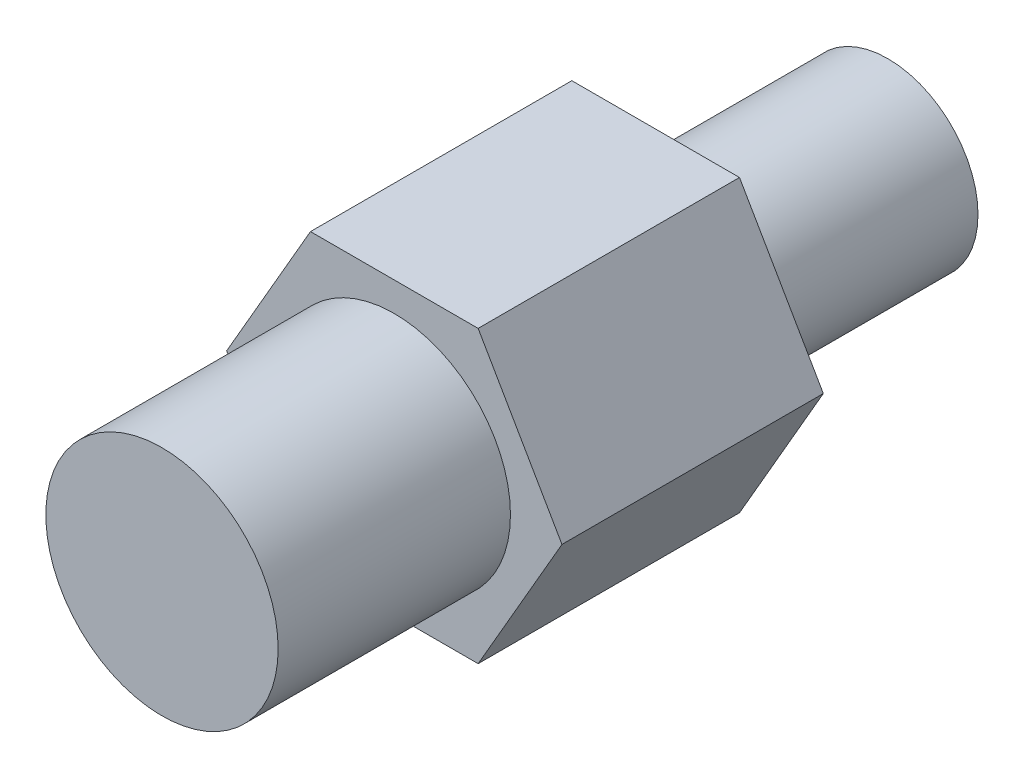
ISO-10303-21;
HEADER;
FILE_DESCRIPTION(('STEP AP214'),'2;1');
FILE_NAME('part.step','',(''),(''),'','','');
FILE_SCHEMA(('AUTOMOTIVE_DESIGN { 1 0 10303 214 1 1 1 1 }'));
ENDSEC;
DATA;
#1=APPLICATION_CONTEXT('core data for automotive mechanical design processes');
#2=APPLICATION_PROTOCOL_DEFINITION('international standard','automotive_design',2000,#1);
#3=PRODUCT_CONTEXT('',#1,'mechanical');
#4=PRODUCT('Part','Part','',(#3));
#5=PRODUCT_RELATED_PRODUCT_CATEGORY('part','',(#4));
#6=PRODUCT_DEFINITION_FORMATION('','',#4);
#7=PRODUCT_DEFINITION_CONTEXT('part definition',#1,'design');
#8=PRODUCT_DEFINITION('design','',#6,#7);
#9=PRODUCT_DEFINITION_SHAPE('','',#8);
#10=(LENGTH_UNIT() NAMED_UNIT(*) SI_UNIT(.MILLI.,.METRE.));
#11=(NAMED_UNIT(*) PLANE_ANGLE_UNIT() SI_UNIT($,.RADIAN.));
#12=(NAMED_UNIT(*) SI_UNIT($,.STERADIAN.) SOLID_ANGLE_UNIT());
#13=UNCERTAINTY_MEASURE_WITH_UNIT(LENGTH_MEASURE(1.E-05),#10,'distance_accuracy_value','');
#14=(GEOMETRIC_REPRESENTATION_CONTEXT(3) GLOBAL_UNCERTAINTY_ASSIGNED_CONTEXT((#13)) GLOBAL_UNIT_ASSIGNED_CONTEXT((#10,
#11,#12)) REPRESENTATION_CONTEXT('',''));
#15=CARTESIAN_POINT('',(0.,0.,0.));
#16=DIRECTION('',(0.,0.,1.));
#17=DIRECTION('',(1.,0.,0.));
#18=AXIS2_PLACEMENT_3D('',#15,#16,#17);
#19=CARTESIAN_POINT('',(0.,0.,25.));
#20=DIRECTION('',(0.,0.,1.));
#21=DIRECTION('',(1.,0.,0.));
#22=AXIS2_PLACEMENT_3D('',#19,#20,#21);
#23=PLANE('',#22);
#24=CARTESIAN_POINT('',(0.,0.,25.));
#25=DIRECTION('',(0.,0.,1.));
#26=DIRECTION('',(1.,0.,0.));
#27=AXIS2_PLACEMENT_3D('',#24,#25,#26);
#28=CIRCLE('',#27,4.);
#29=CARTESIAN_POINT('',(4.,0.,25.));
#30=VERTEX_POINT('',#29);
#31=EDGE_CURVE('E129',#30,#30,#28,.T.);
#32=ORIENTED_EDGE('',*,*,#31,.T.);
#33=EDGE_LOOP('',(#32));
#34=FACE_BOUND('',#33,.T.);
#35=ADVANCED_FACE('F17',(#34),#23,.T.);
#36=CARTESIAN_POINT('',(5.77350269189627,0.,17.));
#37=DIRECTION('',(0.,0.,-1.));
#38=DIRECTION('',(-1.,0.,0.));
#39=AXIS2_PLACEMENT_3D('',#36,#37,#38);
#40=PLANE('',#39);
#41=CARTESIAN_POINT('',(0.,0.,17.));
#42=DIRECTION('',(0.,0.,1.));
#43=DIRECTION('',(1.,0.,0.));
#44=AXIS2_PLACEMENT_3D('',#41,#42,#43);
#45=CIRCLE('',#44,4.);
#46=CARTESIAN_POINT('',(4.,0.,17.));
#47=VERTEX_POINT('',#46);
#48=EDGE_CURVE('E125',#47,#47,#45,.T.);
#49=ORIENTED_EDGE('',*,*,#48,.F.);
#50=EDGE_LOOP('',(#49));
#51=FACE_BOUND('',#50,.T.);
#52=DIRECTION('',(0.5,0.866025403784439,0.));
#53=VECTOR('',#52,1.);
#54=CARTESIAN_POINT('',(-2.88675134594812,5.,17.));
#55=LINE('',#54,#53);
#56=CARTESIAN_POINT('',(-5.77350269189627,0.,17.));
#57=VERTEX_POINT('',#56);
#58=CARTESIAN_POINT('',(-2.88675134594811,5.,17.));
#59=VERTEX_POINT('',#58);
#60=EDGE_CURVE('E106',#57,#59,#55,.T.);
#61=ORIENTED_EDGE('',*,*,#60,.F.);
#62=DIRECTION('',(-0.5,0.866025403784439,0.));
#63=VECTOR('',#62,1.);
#64=CARTESIAN_POINT('',(-5.77350269189625,0.,17.));
#65=LINE('',#64,#63);
#66=CARTESIAN_POINT('',(-2.88675134594815,-5.,17.));
#67=VERTEX_POINT('',#66);
#68=EDGE_CURVE('E117',#67,#57,#65,.T.);
#69=ORIENTED_EDGE('',*,*,#68,.F.);
#70=DIRECTION('',(-1.,0.,0.));
#71=VECTOR('',#70,1.);
#72=CARTESIAN_POINT('',(-2.88675134594813,-5.,17.));
#73=LINE('',#72,#71);
#74=CARTESIAN_POINT('',(2.88675134594813,-5.,17.));
#75=VERTEX_POINT('',#74);
#76=EDGE_CURVE('E120',#75,#67,#73,.T.);
#77=ORIENTED_EDGE('',*,*,#76,.F.);
#78=DIRECTION('',(-0.5,-0.866025403784439,0.));
#79=VECTOR('',#78,1.);
#80=CARTESIAN_POINT('',(2.88675134594813,-5.,17.));
#81=LINE('',#80,#79);
#82=CARTESIAN_POINT('',(5.77350269189626,0.,17.));
#83=VERTEX_POINT('',#82);
#84=EDGE_CURVE('E32',#83,#75,#81,.T.);
#85=ORIENTED_EDGE('',*,*,#84,.F.);
#86=DIRECTION('',(0.5,-0.866025403784439,0.));
#87=VECTOR('',#86,1.);
#88=CARTESIAN_POINT('',(5.77350269189626,0.,17.));
#89=LINE('',#88,#87);
#90=CARTESIAN_POINT('',(2.88675134594813,5.,17.));
#91=VERTEX_POINT('',#90);
#92=EDGE_CURVE('E25',#91,#83,#89,.T.);
#93=ORIENTED_EDGE('',*,*,#92,.F.);
#94=DIRECTION('',(1.,0.,0.));
#95=VECTOR('',#94,1.);
#96=CARTESIAN_POINT('',(2.88675134594813,5.,17.));
#97=LINE('',#96,#95);
#98=EDGE_CURVE('E82',#59,#91,#97,.T.);
#99=ORIENTED_EDGE('',*,*,#98,.F.);
#100=EDGE_LOOP('',(#61,#69,#77,#85,#93,#99));
#101=FACE_BOUND('',#100,.T.);
#102=ADVANCED_FACE('F151',(#51,#101),#40,.F.);
#103=CARTESIAN_POINT('',(0.,0.,0.));
#104=DIRECTION('',(0.,0.,1.));
#105=DIRECTION('',(1.,0.,0.));
#106=AXIS2_PLACEMENT_3D('',#103,#104,#105);
#107=CYLINDRICAL_SURFACE('',#106,4.);
#108=ORIENTED_EDGE('',*,*,#31,.F.);
#109=EDGE_LOOP('',(#108));
#110=FACE_BOUND('',#109,.T.);
#111=ORIENTED_EDGE('',*,*,#48,.T.);
#112=EDGE_LOOP('',(#111));
#113=FACE_BOUND('',#112,.T.);
#114=ADVANCED_FACE('F156',(#110,#113),#107,.T.);
#115=CARTESIAN_POINT('',(2.88675134594813,5.,25.));
#116=DIRECTION('',(0.,-1.,0.));
#117=DIRECTION('',(0.,0.,-1.));
#118=AXIS2_PLACEMENT_3D('',#115,#116,#117);
#119=PLANE('',#118);
#120=DIRECTION('',(0.,0.,-1.));
#121=VECTOR('',#120,1.);
#122=CARTESIAN_POINT('',(2.88675134594813,5.,25.));
#123=LINE('',#122,#121);
#124=CARTESIAN_POINT('',(2.88675134594813,5.,8.));
#125=VERTEX_POINT('',#124);
#126=EDGE_CURVE('E85',#91,#125,#123,.T.);
#127=ORIENTED_EDGE('',*,*,#126,.T.);
#128=DIRECTION('',(-1.,0.,0.));
#129=VECTOR('',#128,1.);
#130=CARTESIAN_POINT('',(2.88675134594813,5.,8.));
#131=LINE('',#130,#129);
#132=CARTESIAN_POINT('',(-2.88675134594811,5.,8.));
#133=VERTEX_POINT('',#132);
#134=EDGE_CURVE('E40',#125,#133,#131,.T.);
#135=ORIENTED_EDGE('',*,*,#134,.T.);
#136=DIRECTION('',(0.,0.,-1.));
#137=VECTOR('',#136,1.);
#138=CARTESIAN_POINT('',(-2.88675134594812,5.,25.));
#139=LINE('',#138,#137);
#140=EDGE_CURVE('E97',#59,#133,#139,.T.);
#141=ORIENTED_EDGE('',*,*,#140,.F.);
#142=ORIENTED_EDGE('',*,*,#98,.T.);
#143=EDGE_LOOP('',(#127,#135,#141,#142));
#144=FACE_BOUND('',#143,.T.);
#145=ADVANCED_FACE('F19',(#144),#119,.F.);
#146=CARTESIAN_POINT('',(-2.88675134594812,5.,25.));
#147=DIRECTION('',(0.866025403784439,-0.5,0.));
#148=DIRECTION('',(0.5,0.866025403784439,0.));
#149=AXIS2_PLACEMENT_3D('',#146,#147,#148);
#150=PLANE('',#149);
#151=ORIENTED_EDGE('',*,*,#140,.T.);
#152=DIRECTION('',(-0.5,-0.866025403784439,0.));
#153=VECTOR('',#152,1.);
#154=CARTESIAN_POINT('',(-2.88675134594812,5.,8.));
#155=LINE('',#154,#153);
#156=CARTESIAN_POINT('',(-5.77350269189627,0.,8.));
#157=VERTEX_POINT('',#156);
#158=EDGE_CURVE('E105',#133,#157,#155,.T.);
#159=ORIENTED_EDGE('',*,*,#158,.T.);
#160=DIRECTION('',(0.,0.,-1.));
#161=VECTOR('',#160,1.);
#162=CARTESIAN_POINT('',(-5.77350269189625,0.,25.));
#163=LINE('',#162,#161);
#164=EDGE_CURVE('E94',#57,#157,#163,.T.);
#165=ORIENTED_EDGE('',*,*,#164,.F.);
#166=ORIENTED_EDGE('',*,*,#60,.T.);
#167=EDGE_LOOP('',(#151,#159,#165,#166));
#168=FACE_BOUND('',#167,.T.);
#169=ADVANCED_FACE('F103',(#168),#150,.F.);
#170=CARTESIAN_POINT('',(-5.77350269189625,0.,25.));
#171=DIRECTION('',(0.866025403784439,0.5,0.));
#172=DIRECTION('',(-0.5,0.866025403784439,0.));
#173=AXIS2_PLACEMENT_3D('',#170,#171,#172);
#174=PLANE('',#173);
#175=ORIENTED_EDGE('',*,*,#164,.T.);
#176=DIRECTION('',(0.5,-0.866025403784439,0.));
#177=VECTOR('',#176,1.);
#178=CARTESIAN_POINT('',(-5.77350269189625,0.,8.));
#179=LINE('',#178,#177);
#180=CARTESIAN_POINT('',(-2.88675134594815,-5.,8.));
#181=VERTEX_POINT('',#180);
#182=EDGE_CURVE('E109',#157,#181,#179,.T.);
#183=ORIENTED_EDGE('',*,*,#182,.T.);
#184=DIRECTION('',(0.,0.,-1.));
#185=VECTOR('',#184,1.);
#186=CARTESIAN_POINT('',(-2.88675134594813,-5.,25.));
#187=LINE('',#186,#185);
#188=EDGE_CURVE('E87',#67,#181,#187,.T.);
#189=ORIENTED_EDGE('',*,*,#188,.F.);
#190=ORIENTED_EDGE('',*,*,#68,.T.);
#191=EDGE_LOOP('',(#175,#183,#189,#190));
#192=FACE_BOUND('',#191,.T.);
#193=ADVANCED_FACE('F177',(#192),#174,.F.);
#194=CARTESIAN_POINT('',(-2.88675134594813,-5.,25.));
#195=DIRECTION('',(0.,1.,0.));
#196=DIRECTION('',(-1.,0.,0.));
#197=AXIS2_PLACEMENT_3D('',#194,#195,#196);
#198=PLANE('',#197);
#199=ORIENTED_EDGE('',*,*,#188,.T.);
#200=DIRECTION('',(1.,0.,0.));
#201=VECTOR('',#200,1.);
#202=CARTESIAN_POINT('',(-2.88675134594813,-5.,8.));
#203=LINE('',#202,#201);
#204=CARTESIAN_POINT('',(2.88675134594813,-5.,8.));
#205=VERTEX_POINT('',#204);
#206=EDGE_CURVE('E81',#181,#205,#203,.T.);
#207=ORIENTED_EDGE('',*,*,#206,.T.);
#208=DIRECTION('',(0.,0.,-1.));
#209=VECTOR('',#208,1.);
#210=CARTESIAN_POINT('',(2.88675134594813,-5.,25.));
#211=LINE('',#210,#209);
#212=EDGE_CURVE('E80',#75,#205,#211,.T.);
#213=ORIENTED_EDGE('',*,*,#212,.F.);
#214=ORIENTED_EDGE('',*,*,#76,.T.);
#215=EDGE_LOOP('',(#199,#207,#213,#214));
#216=FACE_BOUND('',#215,.T.);
#217=ADVANCED_FACE('F172',(#216),#198,.F.);
#218=CARTESIAN_POINT('',(2.88675134594813,-5.,25.));
#219=DIRECTION('',(-0.866025403784439,0.5,0.));
#220=DIRECTION('',(-0.5,-0.866025403784439,0.));
#221=AXIS2_PLACEMENT_3D('',#218,#219,#220);
#222=PLANE('',#221);
#223=ORIENTED_EDGE('',*,*,#212,.T.);
#224=DIRECTION('',(0.5,0.866025403784439,0.));
#225=VECTOR('',#224,1.);
#226=CARTESIAN_POINT('',(2.88675134594813,-5.,8.));
#227=LINE('',#226,#225);
#228=CARTESIAN_POINT('',(5.77350269189626,0.,8.));
#229=VERTEX_POINT('',#228);
#230=EDGE_CURVE('E68',#205,#229,#227,.T.);
#231=ORIENTED_EDGE('',*,*,#230,.T.);
#232=DIRECTION('',(0.,0.,-1.));
#233=VECTOR('',#232,1.);
#234=CARTESIAN_POINT('',(5.77350269189626,0.,25.));
#235=LINE('',#234,#233);
#236=EDGE_CURVE('E78',#83,#229,#235,.T.);
#237=ORIENTED_EDGE('',*,*,#236,.F.);
#238=ORIENTED_EDGE('',*,*,#84,.T.);
#239=EDGE_LOOP('',(#223,#231,#237,#238));
#240=FACE_BOUND('',#239,.T.);
#241=ADVANCED_FACE('F77',(#240),#222,.F.);
#242=CARTESIAN_POINT('',(5.77350269189626,0.,25.));
#243=DIRECTION('',(-0.866025403784439,-0.5,0.));
#244=DIRECTION('',(0.5,-0.866025403784439,0.));
#245=AXIS2_PLACEMENT_3D('',#242,#243,#244);
#246=PLANE('',#245);
#247=ORIENTED_EDGE('',*,*,#236,.T.);
#248=DIRECTION('',(-0.5,0.866025403784439,0.));
#249=VECTOR('',#248,1.);
#250=CARTESIAN_POINT('',(5.77350269189626,0.,8.));
#251=LINE('',#250,#249);
#252=EDGE_CURVE('E11',#229,#125,#251,.T.);
#253=ORIENTED_EDGE('',*,*,#252,.T.);
#254=ORIENTED_EDGE('',*,*,#126,.F.);
#255=ORIENTED_EDGE('',*,*,#92,.T.);
#256=EDGE_LOOP('',(#247,#253,#254,#255));
#257=FACE_BOUND('',#256,.T.);
#258=ADVANCED_FACE('F84',(#257),#246,.F.);
#259=CARTESIAN_POINT('',(5.77350269189626,0.,8.));
#260=DIRECTION('',(0.,0.,1.));
#261=DIRECTION('',(1.,0.,0.));
#262=AXIS2_PLACEMENT_3D('',#259,#260,#261);
#263=PLANE('',#262);
#264=CARTESIAN_POINT('',(0.,0.,8.));
#265=DIRECTION('',(0.,0.,1.));
#266=DIRECTION('',(1.,0.,0.));
#267=AXIS2_PLACEMENT_3D('',#264,#265,#266);
#268=CIRCLE('',#267,3.1);
#269=CARTESIAN_POINT('',(3.1,0.,8.));
#270=VERTEX_POINT('',#269);
#271=EDGE_CURVE('E124',#270,#270,#268,.T.);
#272=ORIENTED_EDGE('',*,*,#271,.T.);
#273=EDGE_LOOP('',(#272));
#274=FACE_BOUND('',#273,.T.);
#275=ORIENTED_EDGE('',*,*,#252,.F.);
#276=ORIENTED_EDGE('',*,*,#230,.F.);
#277=ORIENTED_EDGE('',*,*,#206,.F.);
#278=ORIENTED_EDGE('',*,*,#182,.F.);
#279=ORIENTED_EDGE('',*,*,#158,.F.);
#280=ORIENTED_EDGE('',*,*,#134,.F.);
#281=EDGE_LOOP('',(#275,#276,#277,#278,#279,#280));
#282=FACE_BOUND('',#281,.T.);
#283=ADVANCED_FACE('F67',(#274,#282),#263,.F.);
#284=CARTESIAN_POINT('',(0.,0.,0.));
#285=DIRECTION('',(0.,0.,1.));
#286=DIRECTION('',(1.,0.,0.));
#287=AXIS2_PLACEMENT_3D('',#284,#285,#286);
#288=CYLINDRICAL_SURFACE('',#287,3.1);
#289=ORIENTED_EDGE('',*,*,#271,.F.);
#290=EDGE_LOOP('',(#289));
#291=FACE_BOUND('',#290,.T.);
#292=CARTESIAN_POINT('',(0.,0.,0.));
#293=DIRECTION('',(0.,0.,1.));
#294=DIRECTION('',(1.,0.,0.));
#295=AXIS2_PLACEMENT_3D('',#292,#293,#294);
#296=CIRCLE('',#295,3.1);
#297=CARTESIAN_POINT('',(3.1,0.,0.));
#298=VERTEX_POINT('',#297);
#299=EDGE_CURVE('E128',#298,#298,#296,.T.);
#300=ORIENTED_EDGE('',*,*,#299,.T.);
#301=EDGE_LOOP('',(#300));
#302=FACE_BOUND('',#301,.T.);
#303=ADVANCED_FACE('F137',(#291,#302),#288,.T.);
#304=CARTESIAN_POINT('',(0.,0.,0.));
#305=DIRECTION('',(0.,0.,1.));
#306=DIRECTION('',(1.,0.,0.));
#307=AXIS2_PLACEMENT_3D('',#304,#305,#306);
#308=PLANE('',#307);
#309=ORIENTED_EDGE('',*,*,#299,.F.);
#310=EDGE_LOOP('',(#309));
#311=FACE_BOUND('',#310,.T.);
#312=ADVANCED_FACE('F139',(#311),#308,.F.);
#313=CLOSED_SHELL('',(#35,#102,#114,#145,#169,#193,#217,#241,#258,#283,#303,#312));
#314=MANIFOLD_SOLID_BREP('B1',#313);
#315=ADVANCED_BREP_SHAPE_REPRESENTATION('',(#18,#314),#14);
#316=SHAPE_DEFINITION_REPRESENTATION(#9,#315);
ENDSEC;
END-ISO-10303-21;
